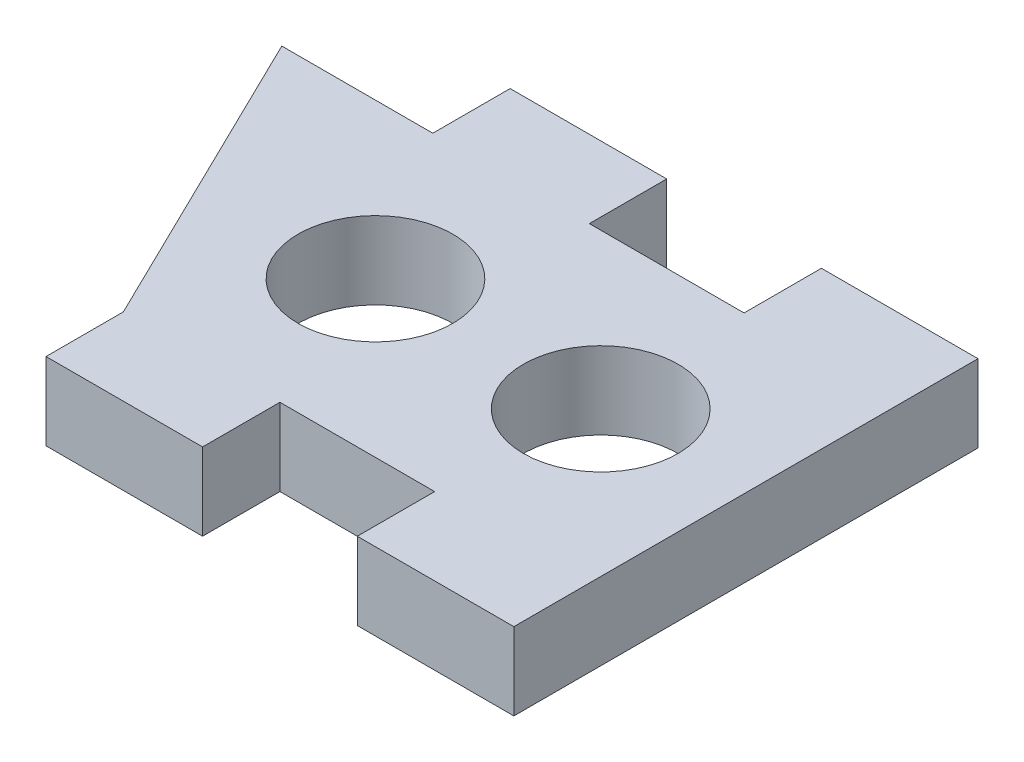
ISO-10303-21;
HEADER;
FILE_DESCRIPTION(('STEP AP214'),'2;1');
FILE_NAME('part.step','',(''),(''),'','','');
FILE_SCHEMA(('AUTOMOTIVE_DESIGN { 1 0 10303 214 1 1 1 1 }'));
ENDSEC;
DATA;
#1=APPLICATION_CONTEXT('core data for automotive mechanical design processes');
#2=APPLICATION_PROTOCOL_DEFINITION('international standard','automotive_design',2000,#1);
#3=PRODUCT_CONTEXT('',#1,'mechanical');
#4=PRODUCT('Part','Part','',(#3));
#5=PRODUCT_RELATED_PRODUCT_CATEGORY('part','',(#4));
#6=PRODUCT_DEFINITION_FORMATION('','',#4);
#7=PRODUCT_DEFINITION_CONTEXT('part definition',#1,'design');
#8=PRODUCT_DEFINITION('design','',#6,#7);
#9=PRODUCT_DEFINITION_SHAPE('','',#8);
#10=(LENGTH_UNIT() NAMED_UNIT(*) SI_UNIT(.MILLI.,.METRE.));
#11=(NAMED_UNIT(*) PLANE_ANGLE_UNIT() SI_UNIT($,.RADIAN.));
#12=(NAMED_UNIT(*) SI_UNIT($,.STERADIAN.) SOLID_ANGLE_UNIT());
#13=UNCERTAINTY_MEASURE_WITH_UNIT(LENGTH_MEASURE(1.E-05),#10,'distance_accuracy_value','');
#14=(GEOMETRIC_REPRESENTATION_CONTEXT(3) GLOBAL_UNCERTAINTY_ASSIGNED_CONTEXT((#13)) GLOBAL_UNIT_ASSIGNED_CONTEXT((#10,
#11,#12)) REPRESENTATION_CONTEXT('',''));
#15=CARTESIAN_POINT('',(0.,0.,0.));
#16=DIRECTION('',(0.,0.,1.));
#17=DIRECTION('',(1.,0.,0.));
#18=AXIS2_PLACEMENT_3D('',#15,#16,#17);
#19=CARTESIAN_POINT('',(-12.7,3.175,-6.35));
#20=DIRECTION('',(0.,0.,1.));
#21=DIRECTION('',(1.,0.,0.));
#22=AXIS2_PLACEMENT_3D('',#19,#20,#21);
#23=PLANE('',#22);
#24=DIRECTION('',(-1.,0.,0.));
#25=VECTOR('',#24,1.);
#26=CARTESIAN_POINT('',(-12.7,0.,-6.35));
#27=LINE('',#26,#25);
#28=CARTESIAN_POINT('',(6.2738,0.,-6.35));
#29=VERTEX_POINT('',#28);
#30=CARTESIAN_POINT('',(-0.0761999999999968,0.,-6.35));
#31=VERTEX_POINT('',#30);
#32=EDGE_CURVE('E171',#29,#31,#27,.T.);
#33=ORIENTED_EDGE('',*,*,#32,.T.);
#34=DIRECTION('',(0.,1.,0.));
#35=VECTOR('',#34,1.);
#36=CARTESIAN_POINT('',(-0.0761999999999968,3.175,-6.35));
#37=LINE('',#36,#35);
#38=CARTESIAN_POINT('',(-0.0761999999999968,3.175,-6.35));
#39=VERTEX_POINT('',#38);
#40=EDGE_CURVE('E66',#31,#39,#37,.T.);
#41=ORIENTED_EDGE('',*,*,#40,.T.);
#42=DIRECTION('',(-1.,0.,0.));
#43=VECTOR('',#42,1.);
#44=CARTESIAN_POINT('',(-12.7,3.175,-6.35));
#45=LINE('',#44,#43);
#46=CARTESIAN_POINT('',(6.2738,3.175,-6.35));
#47=VERTEX_POINT('',#46);
#48=EDGE_CURVE('E51',#47,#39,#45,.T.);
#49=ORIENTED_EDGE('',*,*,#48,.F.);
#50=DIRECTION('',(0.,-1.,0.));
#51=VECTOR('',#50,1.);
#52=CARTESIAN_POINT('',(6.2738,3.175,-6.35));
#53=LINE('',#52,#51);
#54=EDGE_CURVE('E255',#47,#29,#53,.T.);
#55=ORIENTED_EDGE('',*,*,#54,.T.);
#56=EDGE_LOOP('',(#33,#41,#49,#55));
#57=FACE_BOUND('',#56,.T.);
#58=ADVANCED_FACE('F42',(#57),#23,.F.);
#59=CARTESIAN_POINT('',(-12.7,3.175,6.35));
#60=DIRECTION('',(0.,0.,-1.));
#61=DIRECTION('',(-1.,0.,0.));
#62=AXIS2_PLACEMENT_3D('',#59,#60,#61);
#63=PLANE('',#62);
#64=DIRECTION('',(0.,1.,0.));
#65=VECTOR('',#64,1.);
#66=CARTESIAN_POINT('',(-0.0761999999999968,3.175,6.35));
#67=LINE('',#66,#65);
#68=CARTESIAN_POINT('',(-0.0761999999999964,0.,6.35));
#69=VERTEX_POINT('',#68);
#70=CARTESIAN_POINT('',(-0.0761999999999968,3.175,6.35));
#71=VERTEX_POINT('',#70);
#72=EDGE_CURVE('E202',#69,#71,#67,.T.);
#73=ORIENTED_EDGE('',*,*,#72,.F.);
#74=DIRECTION('',(1.,0.,0.));
#75=VECTOR('',#74,1.);
#76=CARTESIAN_POINT('',(-12.7,0.,6.35));
#77=LINE('',#76,#75);
#78=CARTESIAN_POINT('',(6.2738,0.,6.35));
#79=VERTEX_POINT('',#78);
#80=EDGE_CURVE('E176',#69,#79,#77,.T.);
#81=ORIENTED_EDGE('',*,*,#80,.T.);
#82=DIRECTION('',(0.,-1.,0.));
#83=VECTOR('',#82,1.);
#84=CARTESIAN_POINT('',(6.2738,3.175,6.35));
#85=LINE('',#84,#83);
#86=CARTESIAN_POINT('',(6.2738,3.175,6.35));
#87=VERTEX_POINT('',#86);
#88=EDGE_CURVE('E197',#87,#79,#85,.T.);
#89=ORIENTED_EDGE('',*,*,#88,.F.);
#90=DIRECTION('',(1.,0.,0.));
#91=VECTOR('',#90,1.);
#92=CARTESIAN_POINT('',(-12.7,3.175,6.35));
#93=LINE('',#92,#91);
#94=EDGE_CURVE('E175',#71,#87,#93,.T.);
#95=ORIENTED_EDGE('',*,*,#94,.F.);
#96=EDGE_LOOP('',(#73,#81,#89,#95));
#97=FACE_BOUND('',#96,.T.);
#98=ADVANCED_FACE('F44',(#97),#63,.F.);
#99=CARTESIAN_POINT('',(12.7,3.175,-6.35));
#100=DIRECTION('',(-1.,0.,0.));
#101=DIRECTION('',(0.,0.,1.));
#102=AXIS2_PLACEMENT_3D('',#99,#100,#101);
#103=PLANE('',#102);
#104=DIRECTION('',(0.,0.,-1.));
#105=VECTOR('',#104,1.);
#106=CARTESIAN_POINT('',(12.7,0.,-6.35));
#107=LINE('',#106,#105);
#108=CARTESIAN_POINT('',(12.7,0.,9.525));
#109=VERTEX_POINT('',#108);
#110=CARTESIAN_POINT('',(12.7,0.,-9.525));
#111=VERTEX_POINT('',#110);
#112=EDGE_CURVE('E172',#109,#111,#107,.T.);
#113=ORIENTED_EDGE('',*,*,#112,.T.);
#114=DIRECTION('',(0.,1.,0.));
#115=VECTOR('',#114,1.);
#116=CARTESIAN_POINT('',(12.7,3.175,-9.525));
#117=LINE('',#116,#115);
#118=CARTESIAN_POINT('',(12.7,3.175,-9.525));
#119=VERTEX_POINT('',#118);
#120=EDGE_CURVE('E259',#111,#119,#117,.T.);
#121=ORIENTED_EDGE('',*,*,#120,.T.);
#122=DIRECTION('',(0.,0.,-1.));
#123=VECTOR('',#122,1.);
#124=CARTESIAN_POINT('',(12.7,3.175,-6.35));
#125=LINE('',#124,#123);
#126=CARTESIAN_POINT('',(12.7,3.175,9.525));
#127=VERTEX_POINT('',#126);
#128=EDGE_CURVE('E184',#127,#119,#125,.T.);
#129=ORIENTED_EDGE('',*,*,#128,.F.);
#130=DIRECTION('',(0.,1.,0.));
#131=VECTOR('',#130,1.);
#132=CARTESIAN_POINT('',(12.7,3.175,9.525));
#133=LINE('',#132,#131);
#134=EDGE_CURVE('E201',#109,#127,#133,.T.);
#135=ORIENTED_EDGE('',*,*,#134,.F.);
#136=EDGE_LOOP('',(#113,#121,#129,#135));
#137=FACE_BOUND('',#136,.T.);
#138=ADVANCED_FACE('F367',(#137),#103,.F.);
#139=CARTESIAN_POINT('',(-6.5024,3.175,-6.35));
#140=VERTEX_POINT('',#139);
#141=CARTESIAN_POINT('',(-12.7,3.175,-6.35));
#142=VERTEX_POINT('',#141);
#143=EDGE_CURVE('E58',#140,#142,#45,.T.);
#144=ORIENTED_EDGE('',*,*,#143,.F.);
#145=DIRECTION('',(0.,-1.,0.));
#146=VECTOR('',#145,1.);
#147=CARTESIAN_POINT('',(-6.5024,3.175,-6.35));
#148=LINE('',#147,#146);
#149=CARTESIAN_POINT('',(-6.5024,0.,-6.35));
#150=VERTEX_POINT('',#149);
#151=EDGE_CURVE('E168',#140,#150,#148,.T.);
#152=ORIENTED_EDGE('',*,*,#151,.T.);
#153=CARTESIAN_POINT('',(-12.7,0.,-6.35));
#154=VERTEX_POINT('',#153);
#155=EDGE_CURVE('E160',#150,#154,#27,.T.);
#156=ORIENTED_EDGE('',*,*,#155,.T.);
#157=DIRECTION('',(0.,-1.,0.));
#158=VECTOR('',#157,1.);
#159=CARTESIAN_POINT('',(-12.7,3.175,-6.35));
#160=LINE('',#159,#158);
#161=EDGE_CURVE('E11',#142,#154,#160,.T.);
#162=ORIENTED_EDGE('',*,*,#161,.F.);
#163=EDGE_LOOP('',(#144,#152,#156,#162));
#164=FACE_BOUND('',#163,.T.);
#165=ADVANCED_FACE('F166',(#164),#23,.F.);
#166=CARTESIAN_POINT('',(0.,3.175,0.));
#167=DIRECTION('',(0.,1.,0.));
#168=DIRECTION('',(0.,0.,1.));
#169=AXIS2_PLACEMENT_3D('',#166,#167,#168);
#170=PLANE('',#169);
#171=CARTESIAN_POINT('',(-2.50593150774888,3.175,0.));
#172=DIRECTION('',(0.,1.,0.));
#173=DIRECTION('',(0.,0.,1.));
#174=AXIS2_PLACEMENT_3D('',#171,#172,#173);
#175=CIRCLE('',#174,3.175);
#176=CARTESIAN_POINT('',(-2.50593150774888,3.175,3.175));
#177=VERTEX_POINT('',#176);
#178=EDGE_CURVE('E319',#177,#177,#175,.T.);
#179=ORIENTED_EDGE('',*,*,#178,.F.);
#180=EDGE_LOOP('',(#179));
#181=FACE_BOUND('',#180,.T.);
#182=CARTESIAN_POINT('',(6.74130870394418,3.175,0.));
#183=DIRECTION('',(0.,1.,0.));
#184=DIRECTION('',(0.,0.,1.));
#185=AXIS2_PLACEMENT_3D('',#182,#183,#184);
#186=CIRCLE('',#185,3.175);
#187=CARTESIAN_POINT('',(6.74130870394418,3.175,3.175));
#188=VERTEX_POINT('',#187);
#189=EDGE_CURVE('E315',#188,#188,#186,.T.);
#190=ORIENTED_EDGE('',*,*,#189,.F.);
#191=EDGE_LOOP('',(#190));
#192=FACE_BOUND('',#191,.T.);
#193=DIRECTION('',(-0.43856527644785,0.,-0.898699336983299));
#194=VECTOR('',#193,1.);
#195=CARTESIAN_POINT('',(-6.5024,3.175,6.35));
#196=LINE('',#195,#194);
#197=CARTESIAN_POINT('',(-6.5024,3.175,6.35));
#198=VERTEX_POINT('',#197);
#199=EDGE_CURVE('E155',#198,#142,#196,.T.);
#200=ORIENTED_EDGE('',*,*,#199,.F.);
#201=DIRECTION('',(0.,0.,-1.));
#202=VECTOR('',#201,1.);
#203=CARTESIAN_POINT('',(-6.5024,3.175,9.525));
#204=LINE('',#203,#202);
#205=CARTESIAN_POINT('',(-6.5024,3.175,9.525));
#206=VERTEX_POINT('',#205);
#207=EDGE_CURVE('E240',#206,#198,#204,.T.);
#208=ORIENTED_EDGE('',*,*,#207,.F.);
#209=DIRECTION('',(-1.,0.,0.));
#210=VECTOR('',#209,1.);
#211=CARTESIAN_POINT('',(-0.0761999999999968,3.175,9.525));
#212=LINE('',#211,#210);
#213=CARTESIAN_POINT('',(-0.0761999999999968,3.175,9.525));
#214=VERTEX_POINT('',#213);
#215=EDGE_CURVE('E220',#214,#206,#212,.T.);
#216=ORIENTED_EDGE('',*,*,#215,.F.);
#217=DIRECTION('',(0.,0.,-1.));
#218=VECTOR('',#217,1.);
#219=CARTESIAN_POINT('',(-0.0761999999999968,3.175,9.525));
#220=LINE('',#219,#218);
#221=EDGE_CURVE('E244',#214,#71,#220,.T.);
#222=ORIENTED_EDGE('',*,*,#221,.T.);
#223=ORIENTED_EDGE('',*,*,#94,.T.);
#224=DIRECTION('',(0.,0.,-1.));
#225=VECTOR('',#224,1.);
#226=CARTESIAN_POINT('',(6.2738,3.175,9.525));
#227=LINE('',#226,#225);
#228=CARTESIAN_POINT('',(6.2738,3.175,9.525));
#229=VERTEX_POINT('',#228);
#230=EDGE_CURVE('E181',#229,#87,#227,.T.);
#231=ORIENTED_EDGE('',*,*,#230,.F.);
#232=DIRECTION('',(-1.,0.,0.));
#233=VECTOR('',#232,1.);
#234=CARTESIAN_POINT('',(12.7,3.175,9.525));
#235=LINE('',#234,#233);
#236=EDGE_CURVE('E209',#127,#229,#235,.T.);
#237=ORIENTED_EDGE('',*,*,#236,.F.);
#238=ORIENTED_EDGE('',*,*,#128,.T.);
#239=DIRECTION('',(-1.,0.,0.));
#240=VECTOR('',#239,1.);
#241=CARTESIAN_POINT('',(12.7,3.175,-9.525));
#242=LINE('',#241,#240);
#243=CARTESIAN_POINT('',(6.2738,3.175,-9.525));
#244=VERTEX_POINT('',#243);
#245=EDGE_CURVE('E254',#119,#244,#242,.T.);
#246=ORIENTED_EDGE('',*,*,#245,.T.);
#247=DIRECTION('',(0.,0.,1.));
#248=VECTOR('',#247,1.);
#249=CARTESIAN_POINT('',(6.2738,3.175,-9.525));
#250=LINE('',#249,#248);
#251=EDGE_CURVE('E251',#244,#47,#250,.T.);
#252=ORIENTED_EDGE('',*,*,#251,.T.);
#253=ORIENTED_EDGE('',*,*,#48,.T.);
#254=DIRECTION('',(0.,0.,1.));
#255=VECTOR('',#254,1.);
#256=CARTESIAN_POINT('',(-0.0761999999999968,3.175,-9.525));
#257=LINE('',#256,#255);
#258=CARTESIAN_POINT('',(-0.0761999999999968,3.175,-9.525));
#259=VERTEX_POINT('',#258);
#260=EDGE_CURVE('E284',#259,#39,#257,.T.);
#261=ORIENTED_EDGE('',*,*,#260,.F.);
#262=DIRECTION('',(-1.,0.,0.));
#263=VECTOR('',#262,1.);
#264=CARTESIAN_POINT('',(-0.0761999999999968,3.175,-9.525));
#265=LINE('',#264,#263);
#266=CARTESIAN_POINT('',(-6.5024,3.175,-9.525));
#267=VERTEX_POINT('',#266);
#268=EDGE_CURVE('E288',#259,#267,#265,.T.);
#269=ORIENTED_EDGE('',*,*,#268,.T.);
#270=DIRECTION('',(0.,0.,1.));
#271=VECTOR('',#270,1.);
#272=CARTESIAN_POINT('',(-6.5024,3.175,-9.525));
#273=LINE('',#272,#271);
#274=EDGE_CURVE('E281',#267,#140,#273,.T.);
#275=ORIENTED_EDGE('',*,*,#274,.T.);
#276=ORIENTED_EDGE('',*,*,#143,.T.);
#277=EDGE_LOOP('',(#200,#208,#216,#222,#223,#231,#237,#238,#246,#252,#253,#261,#269,#275,#276));
#278=FACE_BOUND('',#277,.T.);
#279=ADVANCED_FACE('F336',(#181,#192,#278),#170,.T.);
#280=CARTESIAN_POINT('',(0.,0.,0.));
#281=DIRECTION('',(0.,1.,0.));
#282=DIRECTION('',(0.,0.,1.));
#283=AXIS2_PLACEMENT_3D('',#280,#281,#282);
#284=PLANE('',#283);
#285=CARTESIAN_POINT('',(-2.50593150774888,0.,0.));
#286=DIRECTION('',(0.,1.,0.));
#287=DIRECTION('',(0.,0.,1.));
#288=AXIS2_PLACEMENT_3D('',#285,#286,#287);
#289=CIRCLE('',#288,3.175);
#290=CARTESIAN_POINT('',(-2.50593150774888,0.,3.175));
#291=VERTEX_POINT('',#290);
#292=EDGE_CURVE('E309',#291,#291,#289,.T.);
#293=ORIENTED_EDGE('',*,*,#292,.T.);
#294=EDGE_LOOP('',(#293));
#295=FACE_BOUND('',#294,.T.);
#296=CARTESIAN_POINT('',(6.74130870394418,0.,0.));
#297=DIRECTION('',(0.,1.,0.));
#298=DIRECTION('',(0.,0.,1.));
#299=AXIS2_PLACEMENT_3D('',#296,#297,#298);
#300=CIRCLE('',#299,3.175);
#301=CARTESIAN_POINT('',(6.74130870394418,0.,3.175));
#302=VERTEX_POINT('',#301);
#303=EDGE_CURVE('E311',#302,#302,#300,.T.);
#304=ORIENTED_EDGE('',*,*,#303,.T.);
#305=EDGE_LOOP('',(#304));
#306=FACE_BOUND('',#305,.T.);
#307=DIRECTION('',(0.,0.,-1.));
#308=VECTOR('',#307,1.);
#309=CARTESIAN_POINT('',(-6.5024,0.,9.525));
#310=LINE('',#309,#308);
#311=CARTESIAN_POINT('',(-6.5024,0.,9.525));
#312=VERTEX_POINT('',#311);
#313=CARTESIAN_POINT('',(-6.5024,0.,6.35));
#314=VERTEX_POINT('',#313);
#315=EDGE_CURVE('E163',#312,#314,#310,.T.);
#316=ORIENTED_EDGE('',*,*,#315,.T.);
#317=DIRECTION('',(-0.43856527644785,0.,-0.898699336983299));
#318=VECTOR('',#317,1.);
#319=CARTESIAN_POINT('',(-6.5024,0.,6.35));
#320=LINE('',#319,#318);
#321=EDGE_CURVE('E152',#314,#154,#320,.T.);
#322=ORIENTED_EDGE('',*,*,#321,.T.);
#323=ORIENTED_EDGE('',*,*,#155,.F.);
#324=DIRECTION('',(0.,0.,1.));
#325=VECTOR('',#324,1.);
#326=CARTESIAN_POINT('',(-6.5024,0.,-9.525));
#327=LINE('',#326,#325);
#328=CARTESIAN_POINT('',(-6.5024,0.,-9.525));
#329=VERTEX_POINT('',#328);
#330=EDGE_CURVE('E278',#329,#150,#327,.T.);
#331=ORIENTED_EDGE('',*,*,#330,.F.);
#332=DIRECTION('',(1.,0.,0.));
#333=VECTOR('',#332,1.);
#334=CARTESIAN_POINT('',(-0.0761999999999964,0.,-9.525));
#335=LINE('',#334,#333);
#336=CARTESIAN_POINT('',(-0.0761999999999964,0.,-9.525));
#337=VERTEX_POINT('',#336);
#338=EDGE_CURVE('E301',#329,#337,#335,.T.);
#339=ORIENTED_EDGE('',*,*,#338,.T.);
#340=DIRECTION('',(0.,0.,1.));
#341=VECTOR('',#340,1.);
#342=CARTESIAN_POINT('',(-0.0761999999999964,0.,-9.525));
#343=LINE('',#342,#341);
#344=EDGE_CURVE('E260',#337,#31,#343,.T.);
#345=ORIENTED_EDGE('',*,*,#344,.T.);
#346=ORIENTED_EDGE('',*,*,#32,.F.);
#347=DIRECTION('',(0.,0.,1.));
#348=VECTOR('',#347,1.);
#349=CARTESIAN_POINT('',(6.2738,0.,-9.525));
#350=LINE('',#349,#348);
#351=CARTESIAN_POINT('',(6.2738,0.,-9.525));
#352=VERTEX_POINT('',#351);
#353=EDGE_CURVE('E248',#352,#29,#350,.T.);
#354=ORIENTED_EDGE('',*,*,#353,.F.);
#355=DIRECTION('',(1.,0.,0.));
#356=VECTOR('',#355,1.);
#357=CARTESIAN_POINT('',(12.7,0.,-9.525));
#358=LINE('',#357,#356);
#359=EDGE_CURVE('E268',#352,#111,#358,.T.);
#360=ORIENTED_EDGE('',*,*,#359,.T.);
#361=ORIENTED_EDGE('',*,*,#112,.F.);
#362=DIRECTION('',(1.,0.,0.));
#363=VECTOR('',#362,1.);
#364=CARTESIAN_POINT('',(12.7,0.,9.525));
#365=LINE('',#364,#363);
#366=CARTESIAN_POINT('',(6.2738,0.,9.525));
#367=VERTEX_POINT('',#366);
#368=EDGE_CURVE('E196',#367,#109,#365,.T.);
#369=ORIENTED_EDGE('',*,*,#368,.F.);
#370=DIRECTION('',(0.,0.,-1.));
#371=VECTOR('',#370,1.);
#372=CARTESIAN_POINT('',(6.2738,0.,9.525));
#373=LINE('',#372,#371);
#374=EDGE_CURVE('E192',#367,#79,#373,.T.);
#375=ORIENTED_EDGE('',*,*,#374,.T.);
#376=ORIENTED_EDGE('',*,*,#80,.F.);
#377=DIRECTION('',(0.,0.,-1.));
#378=VECTOR('',#377,1.);
#379=CARTESIAN_POINT('',(-0.0761999999999964,0.,9.525));
#380=LINE('',#379,#378);
#381=CARTESIAN_POINT('',(-0.0761999999999964,0.,9.525));
#382=VERTEX_POINT('',#381);
#383=EDGE_CURVE('E229',#382,#69,#380,.T.);
#384=ORIENTED_EDGE('',*,*,#383,.F.);
#385=DIRECTION('',(1.,0.,0.));
#386=VECTOR('',#385,1.);
#387=CARTESIAN_POINT('',(-0.0761999999999964,0.,9.525));
#388=LINE('',#387,#386);
#389=EDGE_CURVE('E226',#312,#382,#388,.T.);
#390=ORIENTED_EDGE('',*,*,#389,.F.);
#391=EDGE_LOOP('',(#316,#322,#323,#331,#339,#345,#346,#354,#360,#361,#369,#375,#376,#384,#390));
#392=FACE_BOUND('',#391,.T.);
#393=ADVANCED_FACE('F159',(#295,#306,#392),#284,.F.);
#394=CARTESIAN_POINT('',(6.2738,3.175,9.525));
#395=DIRECTION('',(1.,0.,0.));
#396=DIRECTION('',(0.,0.,-1.));
#397=AXIS2_PLACEMENT_3D('',#394,#395,#396);
#398=PLANE('',#397);
#399=ORIENTED_EDGE('',*,*,#88,.T.);
#400=ORIENTED_EDGE('',*,*,#374,.F.);
#401=DIRECTION('',(0.,-1.,0.));
#402=VECTOR('',#401,1.);
#403=CARTESIAN_POINT('',(6.2738,3.175,9.525));
#404=LINE('',#403,#402);
#405=EDGE_CURVE('E206',#229,#367,#404,.T.);
#406=ORIENTED_EDGE('',*,*,#405,.F.);
#407=ORIENTED_EDGE('',*,*,#230,.T.);
#408=EDGE_LOOP('',(#399,#400,#406,#407));
#409=FACE_BOUND('',#408,.T.);
#410=ADVANCED_FACE('F360',(#409),#398,.F.);
#411=CARTESIAN_POINT('',(0.,0.,9.525));
#412=DIRECTION('',(0.,0.,-1.));
#413=DIRECTION('',(-1.,0.,0.));
#414=AXIS2_PLACEMENT_3D('',#411,#412,#413);
#415=PLANE('',#414);
#416=ORIENTED_EDGE('',*,*,#134,.T.);
#417=ORIENTED_EDGE('',*,*,#236,.T.);
#418=ORIENTED_EDGE('',*,*,#405,.T.);
#419=ORIENTED_EDGE('',*,*,#368,.T.);
#420=EDGE_LOOP('',(#416,#417,#418,#419));
#421=FACE_BOUND('',#420,.T.);
#422=ADVANCED_FACE('F364',(#421),#415,.F.);
#423=CARTESIAN_POINT('',(-0.0761999999999968,3.175,9.525));
#424=DIRECTION('',(-1.,0.,0.));
#425=DIRECTION('',(0.,-1.,0.));
#426=AXIS2_PLACEMENT_3D('',#423,#424,#425);
#427=PLANE('',#426);
#428=ORIENTED_EDGE('',*,*,#72,.T.);
#429=ORIENTED_EDGE('',*,*,#221,.F.);
#430=DIRECTION('',(0.,1.,0.));
#431=VECTOR('',#430,1.);
#432=CARTESIAN_POINT('',(-0.0761999999999968,3.175,9.525));
#433=LINE('',#432,#431);
#434=EDGE_CURVE('E215',#382,#214,#433,.T.);
#435=ORIENTED_EDGE('',*,*,#434,.F.);
#436=ORIENTED_EDGE('',*,*,#383,.T.);
#437=EDGE_LOOP('',(#428,#429,#435,#436));
#438=FACE_BOUND('',#437,.T.);
#439=ADVANCED_FACE('F355',(#438),#427,.F.);
#440=CARTESIAN_POINT('',(-6.5024,3.175,9.525));
#441=DIRECTION('',(1.,0.,0.));
#442=DIRECTION('',(0.,1.,0.));
#443=AXIS2_PLACEMENT_3D('',#440,#441,#442);
#444=PLANE('',#443);
#445=DIRECTION('',(0.,-1.,0.));
#446=VECTOR('',#445,1.);
#447=CARTESIAN_POINT('',(-6.5024,3.175,6.35));
#448=LINE('',#447,#446);
#449=EDGE_CURVE('E219',#198,#314,#448,.T.);
#450=ORIENTED_EDGE('',*,*,#449,.T.);
#451=ORIENTED_EDGE('',*,*,#315,.F.);
#452=DIRECTION('',(0.,-1.,0.));
#453=VECTOR('',#452,1.);
#454=CARTESIAN_POINT('',(-6.5024,3.175,9.525));
#455=LINE('',#454,#453);
#456=EDGE_CURVE('E223',#206,#312,#455,.T.);
#457=ORIENTED_EDGE('',*,*,#456,.F.);
#458=ORIENTED_EDGE('',*,*,#207,.T.);
#459=EDGE_LOOP('',(#450,#451,#457,#458));
#460=FACE_BOUND('',#459,.T.);
#461=ADVANCED_FACE('F345',(#460),#444,.F.);
#462=CARTESIAN_POINT('',(0.,0.,9.525));
#463=DIRECTION('',(0.,0.,-1.));
#464=DIRECTION('',(-1.,0.,0.));
#465=AXIS2_PLACEMENT_3D('',#462,#463,#464);
#466=PLANE('',#465);
#467=ORIENTED_EDGE('',*,*,#434,.T.);
#468=ORIENTED_EDGE('',*,*,#215,.T.);
#469=ORIENTED_EDGE('',*,*,#456,.T.);
#470=ORIENTED_EDGE('',*,*,#389,.T.);
#471=EDGE_LOOP('',(#467,#468,#469,#470));
#472=FACE_BOUND('',#471,.T.);
#473=ADVANCED_FACE('F347',(#472),#466,.F.);
#474=CARTESIAN_POINT('',(6.2738,3.175,-9.525));
#475=DIRECTION('',(-1.,0.,0.));
#476=DIRECTION('',(0.,0.,1.));
#477=AXIS2_PLACEMENT_3D('',#474,#475,#476);
#478=PLANE('',#477);
#479=ORIENTED_EDGE('',*,*,#54,.F.);
#480=ORIENTED_EDGE('',*,*,#251,.F.);
#481=DIRECTION('',(0.,-1.,0.));
#482=VECTOR('',#481,1.);
#483=CARTESIAN_POINT('',(6.2738,3.175,-9.525));
#484=LINE('',#483,#482);
#485=EDGE_CURVE('E264',#244,#352,#484,.T.);
#486=ORIENTED_EDGE('',*,*,#485,.T.);
#487=ORIENTED_EDGE('',*,*,#353,.T.);
#488=EDGE_LOOP('',(#479,#480,#486,#487));
#489=FACE_BOUND('',#488,.T.);
#490=ADVANCED_FACE('F376',(#489),#478,.T.);
#491=CARTESIAN_POINT('',(0.,0.,-9.525));
#492=DIRECTION('',(0.,0.,1.));
#493=DIRECTION('',(-1.,0.,0.));
#494=AXIS2_PLACEMENT_3D('',#491,#492,#493);
#495=PLANE('',#494);
#496=ORIENTED_EDGE('',*,*,#120,.F.);
#497=ORIENTED_EDGE('',*,*,#359,.F.);
#498=ORIENTED_EDGE('',*,*,#485,.F.);
#499=ORIENTED_EDGE('',*,*,#245,.F.);
#500=EDGE_LOOP('',(#496,#497,#498,#499));
#501=FACE_BOUND('',#500,.T.);
#502=ADVANCED_FACE('F373',(#501),#495,.F.);
#503=CARTESIAN_POINT('',(-0.0761999999999968,3.175,-9.525));
#504=DIRECTION('',(1.,0.,0.));
#505=DIRECTION('',(0.,1.,0.));
#506=AXIS2_PLACEMENT_3D('',#503,#504,#505);
#507=PLANE('',#506);
#508=ORIENTED_EDGE('',*,*,#40,.F.);
#509=ORIENTED_EDGE('',*,*,#344,.F.);
#510=DIRECTION('',(0.,1.,0.));
#511=VECTOR('',#510,1.);
#512=CARTESIAN_POINT('',(-0.0761999999999968,3.175,-9.525));
#513=LINE('',#512,#511);
#514=EDGE_CURVE('E291',#337,#259,#513,.T.);
#515=ORIENTED_EDGE('',*,*,#514,.T.);
#516=ORIENTED_EDGE('',*,*,#260,.T.);
#517=EDGE_LOOP('',(#508,#509,#515,#516));
#518=FACE_BOUND('',#517,.T.);
#519=ADVANCED_FACE('F464',(#518),#507,.T.);
#520=CARTESIAN_POINT('',(-6.5024,3.175,-9.525));
#521=DIRECTION('',(-1.,0.,0.));
#522=DIRECTION('',(0.,-1.,0.));
#523=AXIS2_PLACEMENT_3D('',#520,#521,#522);
#524=PLANE('',#523);
#525=ORIENTED_EDGE('',*,*,#151,.F.);
#526=ORIENTED_EDGE('',*,*,#274,.F.);
#527=DIRECTION('',(0.,-1.,0.));
#528=VECTOR('',#527,1.);
#529=CARTESIAN_POINT('',(-6.5024,3.175,-9.525));
#530=LINE('',#529,#528);
#531=EDGE_CURVE('E297',#267,#329,#530,.T.);
#532=ORIENTED_EDGE('',*,*,#531,.T.);
#533=ORIENTED_EDGE('',*,*,#330,.T.);
#534=EDGE_LOOP('',(#525,#526,#532,#533));
#535=FACE_BOUND('',#534,.T.);
#536=ADVANCED_FACE('F473',(#535),#524,.T.);
#537=CARTESIAN_POINT('',(0.,0.,-9.525));
#538=DIRECTION('',(0.,0.,1.));
#539=DIRECTION('',(-1.,0.,0.));
#540=AXIS2_PLACEMENT_3D('',#537,#538,#539);
#541=PLANE('',#540);
#542=ORIENTED_EDGE('',*,*,#514,.F.);
#543=ORIENTED_EDGE('',*,*,#338,.F.);
#544=ORIENTED_EDGE('',*,*,#531,.F.);
#545=ORIENTED_EDGE('',*,*,#268,.F.);
#546=EDGE_LOOP('',(#542,#543,#544,#545));
#547=FACE_BOUND('',#546,.T.);
#548=ADVANCED_FACE('F483',(#547),#541,.F.);
#549=CARTESIAN_POINT('',(-6.5024,0.,6.35));
#550=DIRECTION('',(0.898699336983299,0.,-0.43856527644785));
#551=DIRECTION('',(-0.43856527644785,0.,-0.898699336983299));
#552=AXIS2_PLACEMENT_3D('',#549,#550,#551);
#553=PLANE('',#552);
#554=ORIENTED_EDGE('',*,*,#199,.T.);
#555=ORIENTED_EDGE('',*,*,#161,.T.);
#556=ORIENTED_EDGE('',*,*,#321,.F.);
#557=ORIENTED_EDGE('',*,*,#449,.F.);
#558=EDGE_LOOP('',(#554,#555,#556,#557));
#559=FACE_BOUND('',#558,.T.);
#560=ADVANCED_FACE('F151',(#559),#553,.F.);
#561=CARTESIAN_POINT('',(6.74130870394418,0.,0.));
#562=DIRECTION('',(0.,1.,0.));
#563=DIRECTION('',(0.,0.,1.));
#564=AXIS2_PLACEMENT_3D('',#561,#562,#563);
#565=CYLINDRICAL_SURFACE('',#564,3.175);
#566=ORIENTED_EDGE('',*,*,#303,.F.);
#567=EDGE_LOOP('',(#566));
#568=FACE_BOUND('',#567,.T.);
#569=ORIENTED_EDGE('',*,*,#189,.T.);
#570=EDGE_LOOP('',(#569));
#571=FACE_BOUND('',#570,.T.);
#572=ADVANCED_FACE('F332',(#568,#571),#565,.F.);
#573=CARTESIAN_POINT('',(-2.50593150774888,0.,0.));
#574=DIRECTION('',(0.,1.,0.));
#575=DIRECTION('',(0.,0.,1.));
#576=AXIS2_PLACEMENT_3D('',#573,#574,#575);
#577=CYLINDRICAL_SURFACE('',#576,3.175);
#578=ORIENTED_EDGE('',*,*,#292,.F.);
#579=EDGE_LOOP('',(#578));
#580=FACE_BOUND('',#579,.T.);
#581=ORIENTED_EDGE('',*,*,#178,.T.);
#582=EDGE_LOOP('',(#581));
#583=FACE_BOUND('',#582,.T.);
#584=ADVANCED_FACE('F329',(#580,#583),#577,.F.);
#585=CLOSED_SHELL('',(#58,#98,#138,#165,#279,#393,#410,#422,#439,#461,#473,#490,#502,#519,#536,
#548,#560,#572,#584));
#586=MANIFOLD_SOLID_BREP('B2',#585);
#587=ADVANCED_BREP_SHAPE_REPRESENTATION('',(#18,#586),#14);
#588=SHAPE_DEFINITION_REPRESENTATION(#9,#587);
ENDSEC;
END-ISO-10303-21;
